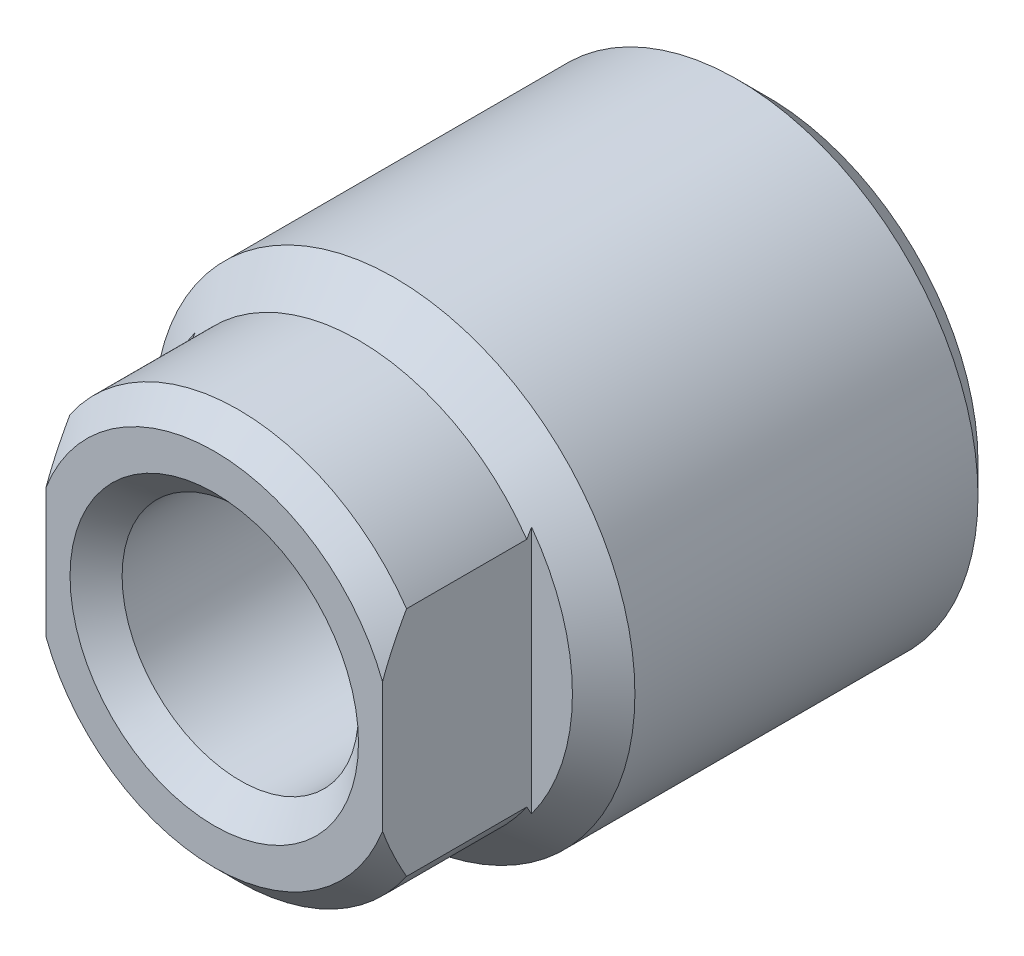
ISO-10303-21;
HEADER;
FILE_DESCRIPTION(('STEP AP214'),'2;1');
FILE_NAME('part.step','',(''),(''),'','','');
FILE_SCHEMA(('AUTOMOTIVE_DESIGN { 1 0 10303 214 1 1 1 1 }'));
ENDSEC;
DATA;
#1=APPLICATION_CONTEXT('core data for automotive mechanical design processes');
#2=APPLICATION_PROTOCOL_DEFINITION('international standard','automotive_design',2000,#1);
#3=PRODUCT_CONTEXT('',#1,'mechanical');
#4=PRODUCT('Part','Part','',(#3));
#5=PRODUCT_RELATED_PRODUCT_CATEGORY('part','',(#4));
#6=PRODUCT_DEFINITION_FORMATION('','',#4);
#7=PRODUCT_DEFINITION_CONTEXT('part definition',#1,'design');
#8=PRODUCT_DEFINITION('design','',#6,#7);
#9=PRODUCT_DEFINITION_SHAPE('','',#8);
#10=(LENGTH_UNIT() NAMED_UNIT(*) SI_UNIT(.MILLI.,.METRE.));
#11=(NAMED_UNIT(*) PLANE_ANGLE_UNIT() SI_UNIT($,.RADIAN.));
#12=(NAMED_UNIT(*) SI_UNIT($,.STERADIAN.) SOLID_ANGLE_UNIT());
#13=UNCERTAINTY_MEASURE_WITH_UNIT(LENGTH_MEASURE(1.E-05),#10,'distance_accuracy_value','');
#14=(GEOMETRIC_REPRESENTATION_CONTEXT(3) GLOBAL_UNCERTAINTY_ASSIGNED_CONTEXT((#13)) GLOBAL_UNIT_ASSIGNED_CONTEXT((#10,
#11,#12)) REPRESENTATION_CONTEXT('',''));
#15=CARTESIAN_POINT('',(0.,0.,0.));
#16=DIRECTION('',(0.,0.,1.));
#17=DIRECTION('',(1.,0.,0.));
#18=AXIS2_PLACEMENT_3D('',#15,#16,#17);
#19=CARTESIAN_POINT('',(0.,0.,11.));
#20=DIRECTION('',(0.,0.,-1.));
#21=DIRECTION('',(-1.,0.,0.));
#22=AXIS2_PLACEMENT_3D('',#19,#20,#21);
#23=CONICAL_SURFACE('',#22,4.25,0.785398163397448);
#24=CARTESIAN_POINT('',(0.,0.,11.));
#25=DIRECTION('',(0.,0.,1.));
#26=DIRECTION('',(1.,0.,0.));
#27=AXIS2_PLACEMENT_3D('',#24,#25,#26);
#28=CIRCLE('',#27,4.25);
#29=CARTESIAN_POINT('',(3.5,2.41091269024824,11.));
#30=VERTEX_POINT('',#29);
#31=CARTESIAN_POINT('',(-3.5,2.41091269024873,11.));
#32=VERTEX_POINT('',#31);
#33=EDGE_CURVE('E159',#30,#32,#28,.T.);
#34=ORIENTED_EDGE('',*,*,#33,.T.);
#35=CARTESIAN_POINT('',(-3.5,8.67992965406266,5.89098409022208));
#36=CARTESIAN_POINT('',(-3.5,8.549087704011,6.01233008445517));
#37=CARTESIAN_POINT('',(-3.5,8.41805682101567,6.13347227529112));
#38=CARTESIAN_POINT('',(-3.5,8.15555996854686,6.37528614756778));
#39=CARTESIAN_POINT('',(-3.5,8.02409399599697,6.49595782566841));
#40=CARTESIAN_POINT('',(-3.5,7.62890385389298,6.857221848517));
#41=CARTESIAN_POINT('',(-3.5,7.3644435816126,7.09701103350003));
#42=CARTESIAN_POINT('',(-3.5,6.83134077527236,7.57515611169457));
#43=CARTESIAN_POINT('',(-3.5,6.56268263545448,7.81349463129001));
#44=CARTESIAN_POINT('',(-3.5,6.02186986828108,8.28612475946837));
#45=CARTESIAN_POINT('',(-3.5,5.74971565895834,8.52041684418101));
#46=CARTESIAN_POINT('',(-3.5,5.25590291883905,8.93647291990068));
#47=CARTESIAN_POINT('',(-3.5,5.03513800024079,9.11929549488044));
#48=CARTESIAN_POINT('',(-3.5,4.58935134296384,9.47983079499538));
#49=CARTESIAN_POINT('',(-3.5,4.36432857906582,9.65754226282024));
#50=CARTESIAN_POINT('',(-3.5,4.02262540288813,9.91838075071741));
#51=CARTESIAN_POINT('',(-3.5,3.90809609714512,10.00432468014));
#52=CARTESIAN_POINT('',(-3.5,3.6773453908558,10.1739059672237));
#53=CARTESIAN_POINT('',(-3.5,3.56112406962504,10.2575434324751));
#54=CARTESIAN_POINT('',(-3.5,3.32672622607737,10.4219432563736));
#55=CARTESIAN_POINT('',(-3.5,3.20855047952229,10.5027067174865));
#56=CARTESIAN_POINT('',(-3.5,2.96984661560912,10.6606669825654));
#57=CARTESIAN_POINT('',(-3.5,2.84931876357742,10.7378641855483));
#58=CARTESIAN_POINT('',(-3.5,2.61005022130212,10.8849348615749));
#59=CARTESIAN_POINT('',(-3.5,2.4914121772027,10.9549744523345));
#60=CARTESIAN_POINT('',(-3.5,2.25112195319722,11.0897532293452));
#61=CARTESIAN_POINT('',(-3.5,2.12946943929948,11.1544918248151));
#62=CARTESIAN_POINT('',(-3.5,1.8828246710118,11.2771437792723));
#63=CARTESIAN_POINT('',(-3.5,1.75783430200038,11.335060895344));
#64=CARTESIAN_POINT('',(-3.5,1.50416235454635,11.4422049918202));
#65=CARTESIAN_POINT('',(-3.5,1.37548180929678,11.4914343775677));
#66=CARTESIAN_POINT('',(-3.5,1.14286212712896,11.5693900105879));
#67=CARTESIAN_POINT('',(-3.5,1.03964103471615,11.6002464787392));
#68=CARTESIAN_POINT('',(-3.5,0.831172733962634,11.654069002252));
#69=CARTESIAN_POINT('',(-3.5,0.725926288875963,11.6770379708218));
#70=CARTESIAN_POINT('',(-3.5,0.5141898766867,11.7139615415441));
#71=CARTESIAN_POINT('',(-3.5,0.407704996389879,11.7279448922352));
#72=CARTESIAN_POINT('',(-3.5,0.193900532898876,11.7462505835943));
#73=CARTESIAN_POINT('',(-3.5,0.0865810007172274,11.7505735101068));
#74=CARTESIAN_POINT('',(-3.5,-0.128320489862899,11.7493020566974));
#75=CARTESIAN_POINT('',(-3.5,-0.235902270669389,11.7436779121679));
#76=CARTESIAN_POINT('',(-3.5,-0.450117113780346,11.722786519246));
#77=CARTESIAN_POINT('',(-3.5,-0.556750101242306,11.707518516849));
#78=CARTESIAN_POINT('',(-3.5,-0.768685962075934,11.6681021711634));
#79=CARTESIAN_POINT('',(-3.5,-0.873983616798879,11.6439261348636));
#80=CARTESIAN_POINT('',(-3.5,-1.08245686490575,11.5878100176202));
#81=CARTESIAN_POINT('',(-3.5,-1.18563235099995,11.5558695451741));
#82=CARTESIAN_POINT('',(-3.5,-1.5129864685914,11.4428609312507));
#83=CARTESIAN_POINT('',(-3.5,-1.73279481447767,11.3490521714819));
#84=CARTESIAN_POINT('',(-3.5,-2.05463210245409,11.1925696625463));
#85=CARTESIAN_POINT('',(-3.5,-2.16071579182379,11.1377085923539));
#86=CARTESIAN_POINT('',(-3.5,-2.37055422638971,11.0236819325053));
#87=CARTESIAN_POINT('',(-3.5,-2.47430926055693,10.9645168808533));
#88=CARTESIAN_POINT('',(-3.5,-2.68103762105484,10.8419452686009));
#89=CARTESIAN_POINT('',(-3.5,-2.78398451084449,10.7784945651641));
#90=CARTESIAN_POINT('',(-3.5,-2.98803023863503,10.6486803913519));
#91=CARTESIAN_POINT('',(-3.5,-3.08912894412825,10.5823167132787));
#92=CARTESIAN_POINT('',(-3.5,-3.38981365843362,10.3798045167886));
#93=CARTESIAN_POINT('',(-3.5,-3.58700455595298,10.240103589252));
#94=CARTESIAN_POINT('',(-3.5,-4.00525449084108,9.93313367490426));
#95=CARTESIAN_POINT('',(-3.5,-4.22554992952102,9.76483538899658));
#96=CARTESIAN_POINT('',(-3.5,-4.66152728505888,9.42233378041466));
#97=CARTESIAN_POINT('',(-3.5,-4.87720851426003,9.24812958744361));
#98=CARTESIAN_POINT('',(-3.5,-5.30529737943397,8.89535689499087));
#99=CARTESIAN_POINT('',(-3.5,-5.51770175228183,8.71678445206721));
#100=CARTESIAN_POINT('',(-3.5,-5.93986268264622,8.35653379934371));
#101=CARTESIAN_POINT('',(-3.5,-6.14961917062347,8.17485550827121));
#102=CARTESIAN_POINT('',(-3.5,-6.55481523686039,7.81988279713606));
#103=CARTESIAN_POINT('',(-3.5,-6.75037240216658,7.64672232590909));
#104=CARTESIAN_POINT('',(-3.5,-7.14002398015361,7.29875705604956));
#105=CARTESIAN_POINT('',(-3.5,-7.33411836241629,7.12395222339197));
#106=CARTESIAN_POINT('',(-3.5,-7.72072571512591,6.77338744046517));
#107=CARTESIAN_POINT('',(-3.5,-7.91324109176676,6.59763014058137));
#108=CARTESIAN_POINT('',(-3.5,-8.29727834042485,6.2450501237332));
#109=CARTESIAN_POINT('',(-3.5,-8.48880025626392,6.06822745451917));
#110=CARTESIAN_POINT('',(-3.5,-8.67992965406265,5.89098409022208));
#111=B_SPLINE_CURVE_WITH_KNOTS('',3,(#35,#36,#37,#38,#39,#40,#41,#42,#43,#44,#45,#46,#47,#48,
#49,#50,#51,#52,#53,#54,#55,#56,#57,#58,#59,#60,#61,#62,#63,#64,#65,#66,#67,#68,#69,#70,#71,#72,
#73,#74,#75,#76,#77,#78,#79,#80,#81,#82,#83,#84,#85,#86,#87,#88,#89,#90,#91,#92,#93,#94,#95,#96,
#97,#98,#99,#100,#101,#102,#103,#104,#105,#106,#107,#108,#109,#110),.UNSPECIFIED.,.F.,.F.,(4,2,
2,2,2,2,2,2,2,2,2,2,2,2,2,2,2,2,2,2,2,2,2,2,2,2,2,2,2,2,2,2,2,2,2,2,2,4),(0.,0.535350036587555,
1.07070386663276,2.1416413510891,3.21903953863934,4.29631007676037,5.15617582250976,
6.01625131305532,6.44579873861161,6.875326092961,7.30468686474273,7.73399947980711,
8.14720266935121,8.5604518467551,8.97347234278525,9.38637830718966,9.70932006924441,
10.0321424257644,10.3539267349947,10.6756915294851,10.9984207699446,11.3211752461031,
11.6449416751101,11.9687244326263,12.6835908467151,13.0418467786956,13.4000580048427,
13.7627947956017,14.1255574919897,14.8503247867132,15.6818686744099,16.513535635968,
17.3459833180757,18.1784528168008,18.9620515337256,19.7456665006495,20.5276949002122,
21.3096885058474),.UNSPECIFIED.);
#112=CARTESIAN_POINT('',(-3.5,1.34629120178363,11.5));
#113=VERTEX_POINT('',#112);
#114=EDGE_CURVE('E166',#32,#113,#111,.T.);
#115=ORIENTED_EDGE('',*,*,#114,.T.);
#116=CARTESIAN_POINT('',(0.,0.,11.5));
#117=DIRECTION('',(0.,0.,1.));
#118=DIRECTION('',(1.,0.,0.));
#119=AXIS2_PLACEMENT_3D('',#116,#117,#118);
#120=CIRCLE('',#119,3.75);
#121=CARTESIAN_POINT('',(3.5,1.34629120178363,11.5));
#122=VERTEX_POINT('',#121);
#123=EDGE_CURVE('E130',#122,#113,#120,.T.);
#124=ORIENTED_EDGE('',*,*,#123,.F.);
#125=CARTESIAN_POINT('',(3.5,-8.67992965406266,5.89098409022208));
#126=CARTESIAN_POINT('',(3.5,-8.549087704011,6.01233008445517));
#127=CARTESIAN_POINT('',(3.5,-8.41805682101567,6.13347227529112));
#128=CARTESIAN_POINT('',(3.5,-8.15555996854686,6.37528614756778));
#129=CARTESIAN_POINT('',(3.5,-8.02409399599697,6.49595782566841));
#130=CARTESIAN_POINT('',(3.5,-7.62890385389298,6.857221848517));
#131=CARTESIAN_POINT('',(3.5,-7.3644435816126,7.09701103350003));
#132=CARTESIAN_POINT('',(3.5,-6.83134077527236,7.57515611169457));
#133=CARTESIAN_POINT('',(3.5,-6.56268263545448,7.81349463129001));
#134=CARTESIAN_POINT('',(3.5,-6.02186986828108,8.28612475946837));
#135=CARTESIAN_POINT('',(3.5,-5.74971565895834,8.52041684418101));
#136=CARTESIAN_POINT('',(3.5,-5.25590291883905,8.93647291990068));
#137=CARTESIAN_POINT('',(3.5,-5.03513800024079,9.11929549488044));
#138=CARTESIAN_POINT('',(3.5,-4.58935134296384,9.47983079499538));
#139=CARTESIAN_POINT('',(3.5,-4.36432857906582,9.65754226282024));
#140=CARTESIAN_POINT('',(3.5,-4.02262540288813,9.91838075071741));
#141=CARTESIAN_POINT('',(3.5,-3.90809609714512,10.00432468014));
#142=CARTESIAN_POINT('',(3.5,-3.6773453908558,10.1739059672237));
#143=CARTESIAN_POINT('',(3.5,-3.56112406962504,10.2575434324751));
#144=CARTESIAN_POINT('',(3.5,-3.32672622607737,10.4219432563736));
#145=CARTESIAN_POINT('',(3.5,-3.20855047952229,10.5027067174865));
#146=CARTESIAN_POINT('',(3.5,-2.96984661560912,10.6606669825654));
#147=CARTESIAN_POINT('',(3.5,-2.84931876357742,10.7378641855483));
#148=CARTESIAN_POINT('',(3.5,-2.61005022130212,10.8849348615749));
#149=CARTESIAN_POINT('',(3.5,-2.4914121772027,10.9549744523345));
#150=CARTESIAN_POINT('',(3.5,-2.25112195319722,11.0897532293452));
#151=CARTESIAN_POINT('',(3.5,-2.12946943929948,11.1544918248151));
#152=CARTESIAN_POINT('',(3.5,-1.8828246710118,11.2771437792723));
#153=CARTESIAN_POINT('',(3.5,-1.75783430200038,11.335060895344));
#154=CARTESIAN_POINT('',(3.5,-1.50416235454635,11.4422049918202));
#155=CARTESIAN_POINT('',(3.5,-1.37548180929678,11.4914343775677));
#156=CARTESIAN_POINT('',(3.5,-1.14286212712896,11.5693900105879));
#157=CARTESIAN_POINT('',(3.5,-1.03964103471615,11.6002464787392));
#158=CARTESIAN_POINT('',(3.5,-0.831172733962634,11.654069002252));
#159=CARTESIAN_POINT('',(3.5,-0.725926288875963,11.6770379708218));
#160=CARTESIAN_POINT('',(3.5,-0.5141898766867,11.7139615415441));
#161=CARTESIAN_POINT('',(3.5,-0.407704996389879,11.7279448922352));
#162=CARTESIAN_POINT('',(3.5,-0.193900532898876,11.7462505835943));
#163=CARTESIAN_POINT('',(3.5,-0.0865810007172274,11.7505735101068));
#164=CARTESIAN_POINT('',(3.5,0.128320489862899,11.7493020566974));
#165=CARTESIAN_POINT('',(3.5,0.235902270669389,11.7436779121679));
#166=CARTESIAN_POINT('',(3.5,0.450117113780346,11.722786519246));
#167=CARTESIAN_POINT('',(3.5,0.556750101242306,11.707518516849));
#168=CARTESIAN_POINT('',(3.5,0.768685962075934,11.6681021711634));
#169=CARTESIAN_POINT('',(3.5,0.873983616798879,11.6439261348636));
#170=CARTESIAN_POINT('',(3.5,1.08245686490575,11.5878100176202));
#171=CARTESIAN_POINT('',(3.5,1.18563235099995,11.5558695451741));
#172=CARTESIAN_POINT('',(3.5,1.5129864685914,11.4428609312507));
#173=CARTESIAN_POINT('',(3.5,1.73279481447767,11.3490521714819));
#174=CARTESIAN_POINT('',(3.5,2.05463210245409,11.1925696625463));
#175=CARTESIAN_POINT('',(3.5,2.16071579182379,11.1377085923539));
#176=CARTESIAN_POINT('',(3.5,2.37055422638971,11.0236819325053));
#177=CARTESIAN_POINT('',(3.5,2.47430926055693,10.9645168808533));
#178=CARTESIAN_POINT('',(3.5,2.68103762105484,10.8419452686009));
#179=CARTESIAN_POINT('',(3.5,2.78398451084449,10.7784945651641));
#180=CARTESIAN_POINT('',(3.5,2.98803023863503,10.6486803913519));
#181=CARTESIAN_POINT('',(3.5,3.08912894412825,10.5823167132787));
#182=CARTESIAN_POINT('',(3.5,3.38981365843362,10.3798045167886));
#183=CARTESIAN_POINT('',(3.5,3.58700455595298,10.240103589252));
#184=CARTESIAN_POINT('',(3.5,4.00525449084108,9.93313367490426));
#185=CARTESIAN_POINT('',(3.5,4.22554992952102,9.76483538899658));
#186=CARTESIAN_POINT('',(3.5,4.66152728505888,9.42233378041466));
#187=CARTESIAN_POINT('',(3.5,4.87720851426003,9.24812958744361));
#188=CARTESIAN_POINT('',(3.5,5.30529737943397,8.89535689499087));
#189=CARTESIAN_POINT('',(3.5,5.51770175228183,8.71678445206721));
#190=CARTESIAN_POINT('',(3.5,5.93986268264622,8.35653379934371));
#191=CARTESIAN_POINT('',(3.5,6.14961917062347,8.17485550827121));
#192=CARTESIAN_POINT('',(3.5,6.55481523686039,7.81988279713606));
#193=CARTESIAN_POINT('',(3.5,6.75037240216658,7.64672232590909));
#194=CARTESIAN_POINT('',(3.5,7.14002398015361,7.29875705604956));
#195=CARTESIAN_POINT('',(3.5,7.33411836241629,7.12395222339197));
#196=CARTESIAN_POINT('',(3.5,7.72072571512591,6.77338744046517));
#197=CARTESIAN_POINT('',(3.5,7.91324109176676,6.59763014058137));
#198=CARTESIAN_POINT('',(3.5,8.29727834042485,6.2450501237332));
#199=CARTESIAN_POINT('',(3.5,8.48880025626392,6.06822745451917));
#200=CARTESIAN_POINT('',(3.5,8.67992965406265,5.89098409022208));
#201=B_SPLINE_CURVE_WITH_KNOTS('',3,(#125,#126,#127,#128,#129,#130,#131,#132,#133,#134,#135,
#136,#137,#138,#139,#140,#141,#142,#143,#144,#145,#146,#147,#148,#149,#150,#151,#152,#153,#154,
#155,#156,#157,#158,#159,#160,#161,#162,#163,#164,#165,#166,#167,#168,#169,#170,#171,#172,#173,
#174,#175,#176,#177,#178,#179,#180,#181,#182,#183,#184,#185,#186,#187,#188,#189,#190,#191,#192,
#193,#194,#195,#196,#197,#198,#199,#200),.UNSPECIFIED.,.F.,.F.,(4,2,2,2,2,2,2,2,2,2,2,2,2,2,2,2,
2,2,2,2,2,2,2,2,2,2,2,2,2,2,2,2,2,2,2,2,2,4),(0.,0.535350036587555,1.07070386663276,
2.1416413510891,3.21903953863934,4.29631007676037,5.15617582250976,6.01625131305532,
6.44579873861161,6.875326092961,7.30468686474273,7.73399947980711,8.14720266935121,
8.5604518467551,8.97347234278525,9.38637830718966,9.70932006924441,10.0321424257644,
10.3539267349947,10.6756915294851,10.9984207699446,11.3211752461031,11.6449416751101,
11.9687244326263,12.6835908467151,13.0418467786956,13.4000580048427,13.7627947956017,
14.1255574919897,14.8503247867132,15.6818686744099,16.513535635968,17.3459833180757,
18.1784528168008,18.9620515337256,19.7456665006495,20.5276949002122,21.3096885058474),.UNSPECIFIED.);
#202=EDGE_CURVE('E199',#122,#30,#201,.T.);
#203=ORIENTED_EDGE('',*,*,#202,.T.);
#204=EDGE_LOOP('',(#34,#115,#124,#203));
#205=FACE_BOUND('',#204,.T.);
#206=ADVANCED_FACE('F36',(#205),#23,.T.);
#207=CARTESIAN_POINT('',(0.,0.,0.));
#208=DIRECTION('',(0.,0.,1.));
#209=DIRECTION('',(1.,0.,0.));
#210=AXIS2_PLACEMENT_3D('',#207,#208,#209);
#211=CYLINDRICAL_SURFACE('',#210,4.25);
#212=CARTESIAN_POINT('',(0.,0.,8.5));
#213=DIRECTION('',(0.,0.,1.));
#214=DIRECTION('',(1.,0.,0.));
#215=AXIS2_PLACEMENT_3D('',#212,#213,#214);
#216=CIRCLE('',#215,4.25);
#217=CARTESIAN_POINT('',(3.5,2.41091269024824,8.5));
#218=VERTEX_POINT('',#217);
#219=CARTESIAN_POINT('',(-3.5,2.41091269024824,8.5));
#220=VERTEX_POINT('',#219);
#221=EDGE_CURVE('E155',#218,#220,#216,.T.);
#222=ORIENTED_EDGE('',*,*,#221,.T.);
#223=DIRECTION('',(0.,0.,1.));
#224=VECTOR('',#223,1.);
#225=CARTESIAN_POINT('',(-3.5,2.41091269024824,0.));
#226=LINE('',#225,#224);
#227=EDGE_CURVE('E121',#220,#32,#226,.T.);
#228=ORIENTED_EDGE('',*,*,#227,.T.);
#229=ORIENTED_EDGE('',*,*,#33,.F.);
#230=DIRECTION('',(0.,0.,1.));
#231=VECTOR('',#230,1.);
#232=CARTESIAN_POINT('',(3.5,2.41091269024824,0.));
#233=LINE('',#232,#231);
#234=EDGE_CURVE('E128',#30,#218,#233,.F.);
#235=ORIENTED_EDGE('',*,*,#234,.T.);
#236=EDGE_LOOP('',(#222,#228,#229,#235));
#237=FACE_BOUND('',#236,.T.);
#238=ADVANCED_FACE('F223',(#237),#211,.T.);
#239=CARTESIAN_POINT('',(-3.5,-1.34629120178363,11.5));
#240=VERTEX_POINT('',#239);
#241=CARTESIAN_POINT('',(3.5,-1.34629120178363,11.5));
#242=VERTEX_POINT('',#241);
#243=EDGE_CURVE('E133',#240,#242,#120,.T.);
#244=ORIENTED_EDGE('',*,*,#243,.F.);
#245=CARTESIAN_POINT('',(-3.5,-2.41091269024824,11.));
#246=VERTEX_POINT('',#245);
#247=EDGE_CURVE('E167',#240,#246,#111,.T.);
#248=ORIENTED_EDGE('',*,*,#247,.T.);
#249=CARTESIAN_POINT('',(3.5,-2.41091269024873,11.));
#250=VERTEX_POINT('',#249);
#251=EDGE_CURVE('E162',#246,#250,#28,.T.);
#252=ORIENTED_EDGE('',*,*,#251,.T.);
#253=EDGE_CURVE('E112',#250,#242,#201,.T.);
#254=ORIENTED_EDGE('',*,*,#253,.T.);
#255=EDGE_LOOP('',(#244,#248,#252,#254));
#256=FACE_BOUND('',#255,.T.);
#257=ADVANCED_FACE('F38',(#256),#23,.T.);
#258=CARTESIAN_POINT('',(0.,3.75,11.5));
#259=DIRECTION('',(0.,0.,-1.));
#260=DIRECTION('',(-1.,0.,0.));
#261=AXIS2_PLACEMENT_3D('',#258,#259,#260);
#262=PLANE('',#261);
#263=CARTESIAN_POINT('',(0.,0.,11.5));
#264=DIRECTION('',(0.,0.,1.));
#265=DIRECTION('',(1.,0.,0.));
#266=AXIS2_PLACEMENT_3D('',#263,#264,#265);
#267=CIRCLE('',#266,3.);
#268=CARTESIAN_POINT('',(3.,0.,11.5));
#269=VERTEX_POINT('',#268);
#270=EDGE_CURVE('E134',#269,#269,#267,.T.);
#271=ORIENTED_EDGE('',*,*,#270,.F.);
#272=EDGE_LOOP('',(#271));
#273=FACE_BOUND('',#272,.T.);
#274=ORIENTED_EDGE('',*,*,#123,.T.);
#275=DIRECTION('',(0.,-1.,0.));
#276=VECTOR('',#275,1.);
#277=CARTESIAN_POINT('',(-3.5,3.75,11.5));
#278=LINE('',#277,#276);
#279=EDGE_CURVE('E163',#113,#240,#278,.T.);
#280=ORIENTED_EDGE('',*,*,#279,.T.);
#281=ORIENTED_EDGE('',*,*,#243,.T.);
#282=DIRECTION('',(0.,1.,0.));
#283=VECTOR('',#282,1.);
#284=CARTESIAN_POINT('',(3.5,3.75,11.5));
#285=LINE('',#284,#283);
#286=EDGE_CURVE('E205',#242,#122,#285,.T.);
#287=ORIENTED_EDGE('',*,*,#286,.T.);
#288=EDGE_LOOP('',(#274,#280,#281,#287));
#289=FACE_BOUND('',#288,.T.);
#290=ADVANCED_FACE('F215',(#273,#289),#262,.F.);
#291=CARTESIAN_POINT('',(0.,0.,11.5));
#292=DIRECTION('',(0.,0.,1.));
#293=DIRECTION('',(1.,0.,0.));
#294=AXIS2_PLACEMENT_3D('',#291,#292,#293);
#295=CONICAL_SURFACE('',#294,3.,0.78539816339745);
#296=CARTESIAN_POINT('',(0.,0.,10.9585));
#297=DIRECTION('',(0.,0.,1.));
#298=DIRECTION('',(1.,0.,0.));
#299=AXIS2_PLACEMENT_3D('',#296,#297,#298);
#300=CIRCLE('',#299,2.4585);
#301=CARTESIAN_POINT('',(2.4585,0.,10.9585));
#302=VERTEX_POINT('',#301);
#303=EDGE_CURVE('E137',#302,#302,#300,.T.);
#304=ORIENTED_EDGE('',*,*,#303,.F.);
#305=EDGE_LOOP('',(#304));
#306=FACE_BOUND('',#305,.T.);
#307=ORIENTED_EDGE('',*,*,#270,.T.);
#308=EDGE_LOOP('',(#307));
#309=FACE_BOUND('',#308,.T.);
#310=ADVANCED_FACE('F237',(#306,#309),#295,.F.);
#311=CARTESIAN_POINT('',(0.,0.,0.));
#312=DIRECTION('',(0.,0.,1.));
#313=DIRECTION('',(1.,0.,0.));
#314=AXIS2_PLACEMENT_3D('',#311,#312,#313);
#315=CYLINDRICAL_SURFACE('',#314,2.4585);
#316=CARTESIAN_POINT('',(0.,0.,0.5415));
#317=DIRECTION('',(0.,0.,1.));
#318=DIRECTION('',(1.,0.,0.));
#319=AXIS2_PLACEMENT_3D('',#316,#317,#318);
#320=CIRCLE('',#319,2.4585);
#321=CARTESIAN_POINT('',(2.4585,0.,0.5415));
#322=VERTEX_POINT('',#321);
#323=EDGE_CURVE('E140',#322,#322,#320,.T.);
#324=ORIENTED_EDGE('',*,*,#323,.F.);
#325=EDGE_LOOP('',(#324));
#326=FACE_BOUND('',#325,.T.);
#327=ORIENTED_EDGE('',*,*,#303,.T.);
#328=EDGE_LOOP('',(#327));
#329=FACE_BOUND('',#328,.T.);
#330=ADVANCED_FACE('F242',(#326,#329),#315,.F.);
#331=CARTESIAN_POINT('',(0.,0.,0.5415));
#332=DIRECTION('',(0.,0.,-1.));
#333=DIRECTION('',(-1.,0.,0.));
#334=AXIS2_PLACEMENT_3D('',#331,#332,#333);
#335=CONICAL_SURFACE('',#334,2.4585,0.785398163397449);
#336=CARTESIAN_POINT('',(0.,0.,0.));
#337=DIRECTION('',(0.,0.,1.));
#338=DIRECTION('',(1.,0.,0.));
#339=AXIS2_PLACEMENT_3D('',#336,#337,#338);
#340=CIRCLE('',#339,3.);
#341=CARTESIAN_POINT('',(3.,0.,0.));
#342=VERTEX_POINT('',#341);
#343=EDGE_CURVE('E143',#342,#342,#340,.T.);
#344=ORIENTED_EDGE('',*,*,#343,.F.);
#345=EDGE_LOOP('',(#344));
#346=FACE_BOUND('',#345,.T.);
#347=ORIENTED_EDGE('',*,*,#323,.T.);
#348=EDGE_LOOP('',(#347));
#349=FACE_BOUND('',#348,.T.);
#350=ADVANCED_FACE('F249',(#346,#349),#335,.F.);
#351=CARTESIAN_POINT('',(0.,3.,0.));
#352=DIRECTION('',(0.,0.,1.));
#353=DIRECTION('',(1.,0.,0.));
#354=AXIS2_PLACEMENT_3D('',#351,#352,#353);
#355=PLANE('',#354);
#356=CARTESIAN_POINT('',(0.,0.,0.));
#357=DIRECTION('',(0.,0.,1.));
#358=DIRECTION('',(1.,0.,0.));
#359=AXIS2_PLACEMENT_3D('',#356,#357,#358);
#360=CIRCLE('',#359,4.3865);
#361=CARTESIAN_POINT('',(4.3865,0.,0.));
#362=VERTEX_POINT('',#361);
#363=EDGE_CURVE('E146',#362,#362,#360,.T.);
#364=ORIENTED_EDGE('',*,*,#363,.F.);
#365=EDGE_LOOP('',(#364));
#366=FACE_BOUND('',#365,.T.);
#367=ORIENTED_EDGE('',*,*,#343,.T.);
#368=EDGE_LOOP('',(#367));
#369=FACE_BOUND('',#368,.T.);
#370=ADVANCED_FACE('F253',(#366,#369),#355,.F.);
#371=CARTESIAN_POINT('',(0.,0.,0.));
#372=DIRECTION('',(0.,0.,1.));
#373=DIRECTION('',(1.,0.,0.));
#374=AXIS2_PLACEMENT_3D('',#371,#372,#373);
#375=CONICAL_SURFACE('',#374,4.3865,0.785398163397449);
#376=CARTESIAN_POINT('',(0.,0.,0.6135));
#377=DIRECTION('',(0.,0.,1.));
#378=DIRECTION('',(1.,0.,0.));
#379=AXIS2_PLACEMENT_3D('',#376,#377,#378);
#380=CIRCLE('',#379,5.);
#381=CARTESIAN_POINT('',(5.,0.,0.6135));
#382=VERTEX_POINT('',#381);
#383=EDGE_CURVE('E149',#382,#382,#380,.T.);
#384=ORIENTED_EDGE('',*,*,#383,.F.);
#385=EDGE_LOOP('',(#384));
#386=FACE_BOUND('',#385,.T.);
#387=ORIENTED_EDGE('',*,*,#363,.T.);
#388=EDGE_LOOP('',(#387));
#389=FACE_BOUND('',#388,.T.);
#390=ADVANCED_FACE('F257',(#386,#389),#375,.T.);
#391=CARTESIAN_POINT('',(0.,0.,0.));
#392=DIRECTION('',(0.,0.,1.));
#393=DIRECTION('',(1.,0.,0.));
#394=AXIS2_PLACEMENT_3D('',#391,#392,#393);
#395=CYLINDRICAL_SURFACE('',#394,5.);
#396=CARTESIAN_POINT('',(0.,0.,7.75));
#397=DIRECTION('',(0.,0.,1.));
#398=DIRECTION('',(1.,0.,0.));
#399=AXIS2_PLACEMENT_3D('',#396,#397,#398);
#400=CIRCLE('',#399,5.);
#401=CARTESIAN_POINT('',(5.,0.,7.75));
#402=VERTEX_POINT('',#401);
#403=EDGE_CURVE('E152',#402,#402,#400,.T.);
#404=ORIENTED_EDGE('',*,*,#403,.F.);
#405=EDGE_LOOP('',(#404));
#406=FACE_BOUND('',#405,.T.);
#407=ORIENTED_EDGE('',*,*,#383,.T.);
#408=EDGE_LOOP('',(#407));
#409=FACE_BOUND('',#408,.T.);
#410=ADVANCED_FACE('F227',(#406,#409),#395,.T.);
#411=CARTESIAN_POINT('',(0.,0.,7.75));
#412=DIRECTION('',(0.,0.,-1.));
#413=DIRECTION('',(-1.,0.,0.));
#414=AXIS2_PLACEMENT_3D('',#411,#412,#413);
#415=CONICAL_SURFACE('',#414,5.,0.785398163397448);
#416=CARTESIAN_POINT('',(0.,0.,8.4));
#417=DIRECTION('',(0.,0.,-1.));
#418=DIRECTION('',(-1.,0.,0.));
#419=AXIS2_PLACEMENT_3D('',#416,#417,#418);
#420=CIRCLE('',#419,4.35);
#421=CARTESIAN_POINT('',(-3.5,-2.5831182706179,8.4));
#422=VERTEX_POINT('',#421);
#423=CARTESIAN_POINT('',(-3.5,2.5831182706179,8.4));
#424=VERTEX_POINT('',#423);
#425=EDGE_CURVE('E11',#422,#424,#420,.T.);
#426=ORIENTED_EDGE('',*,*,#425,.T.);
#427=CARTESIAN_POINT('',(-3.5,9.74078282761453,2.39950000749963));
#428=CARTESIAN_POINT('',(-3.5,9.5867799074486,2.54442863796654));
#429=CARTESIAN_POINT('',(-3.5,9.43258362030784,2.68915168453825));
#430=CARTESIAN_POINT('',(-3.5,9.12374083345768,2.97811836638069));
#431=CARTESIAN_POINT('',(-3.5,8.96909433107869,3.12236199879778));
#432=CARTESIAN_POINT('',(-3.5,8.50415397093375,3.55448543708457));
#433=CARTESIAN_POINT('',(-3.5,8.19309077845915,3.84153952112968));
#434=CARTESIAN_POINT('',(-3.5,7.55968006373182,4.42042763119953));
#435=CARTESIAN_POINT('',(-3.5,7.23725626629442,4.7121782976377));
#436=CARTESIAN_POINT('',(-3.5,6.58855553337733,5.29094872287458));
#437=CARTESIAN_POINT('',(-3.5,6.26228132407499,5.57797152025127));
#438=CARTESIAN_POINT('',(-3.5,5.76850884464538,6.00323817269817));
#439=CARTESIAN_POINT('',(-3.5,5.60324336301629,6.14407271009514));
#440=CARTESIAN_POINT('',(-3.5,5.27087183050439,6.42355004352788));
#441=CARTESIAN_POINT('',(-3.5,5.10376582185616,6.56219288967935));
#442=CARTESIAN_POINT('',(-3.5,4.76689698844052,6.83698134288485));
#443=CARTESIAN_POINT('',(-3.5,4.59712914594213,6.97312081481323));
#444=CARTESIAN_POINT('',(-3.5,4.25471140534054,7.24170833371619));
#445=CARTESIAN_POINT('',(-3.5,4.08206177194809,7.37415671678943));
#446=CARTESIAN_POINT('',(-3.5,3.73506085798265,7.63263572682679));
#447=CARTESIAN_POINT('',(-3.5,3.56075150112958,7.75872235583338));
#448=CARTESIAN_POINT('',(-3.5,3.20741367976623,8.00433459797698));
#449=CARTESIAN_POINT('',(-3.5,3.02838316638671,8.12385729078381));
#450=CARTESIAN_POINT('',(-3.5,2.66503976043353,8.3531130307753));
#451=CARTESIAN_POINT('',(-3.5,2.48074901816126,8.46288087151587));
#452=CARTESIAN_POINT('',(-3.5,2.10482069586695,8.6688785949399));
#453=CARTESIAN_POINT('',(-3.5,1.9131918700783,8.76512400647501));
#454=CARTESIAN_POINT('',(-3.5,1.61111949925362,8.89815734998096));
#455=CARTESIAN_POINT('',(-3.5,1.50377468267197,8.94196216844729));
#456=CARTESIAN_POINT('',(-3.5,1.28639210165815,9.02245353737203));
#457=CARTESIAN_POINT('',(-3.5,1.17635385542785,9.05913880365679));
#458=CARTESIAN_POINT('',(-3.5,0.95438206950261,9.1237555485861));
#459=CARTESIAN_POINT('',(-3.5,0.842462868724564,9.15173562759878));
#460=CARTESIAN_POINT('',(-3.5,0.616589469646223,9.19782146842829));
#461=CARTESIAN_POINT('',(-3.5,0.502635508588888,9.21592837374417));
#462=CARTESIAN_POINT('',(-3.5,0.272023887576203,9.24133810998241));
#463=CARTESIAN_POINT('',(-3.5,0.15535029727689,9.24849932993092));
#464=CARTESIAN_POINT('',(-3.5,-0.0781192251632082,9.25107463743734));
#465=CARTESIAN_POINT('',(-3.5,-0.194915147172848,9.24648963107796));
#466=CARTESIAN_POINT('',(-3.5,-0.427893805061345,9.22585850220542));
#467=CARTESIAN_POINT('',(-3.5,-0.544072845153065,9.20977137866978));
#468=CARTESIAN_POINT('',(-3.5,-0.77448625305923,9.16712549959073));
#469=CARTESIAN_POINT('',(-3.5,-0.888720044789015,9.14056369636126));
#470=CARTESIAN_POINT('',(-3.5,-1.15770895661471,9.06655235147306));
#471=CARTESIAN_POINT('',(-3.5,-1.31132891999205,9.01500043877718));
#472=CARTESIAN_POINT('',(-3.5,-1.61339028565325,8.89856546220363));
#473=CARTESIAN_POINT('',(-3.5,-1.76182857088823,8.83367453053451));
#474=CARTESIAN_POINT('',(-3.5,-2.0554986833968,8.69312126719446));
#475=CARTESIAN_POINT('',(-3.5,-2.20067617247206,8.61734671309573));
#476=CARTESIAN_POINT('',(-3.5,-2.41518774313175,8.49798652514006));
#477=CARTESIAN_POINT('',(-3.5,-2.48614005966028,8.45725578779337));
#478=CARTESIAN_POINT('',(-3.5,-2.62706112335527,8.37413265470055));
#479=CARTESIAN_POINT('',(-3.5,-2.69702991989062,8.33174034276664));
#480=CARTESIAN_POINT('',(-3.5,-2.93807504039359,8.1822740830277));
#481=CARTESIAN_POINT('',(-3.5,-3.10688959707627,8.07154846264788));
#482=CARTESIAN_POINT('',(-3.5,-3.44025211336702,7.84382506656342));
#483=CARTESIAN_POINT('',(-3.5,-3.60479882767985,7.72682549008682));
#484=CARTESIAN_POINT('',(-3.5,-3.93065198831303,7.48808729565824));
#485=CARTESIAN_POINT('',(-3.5,-4.09195511192136,7.36634415946182));
#486=CARTESIAN_POINT('',(-3.5,-4.41183254831665,7.11937399526806));
#487=CARTESIAN_POINT('',(-3.5,-4.57040715019011,6.99414734007385));
#488=CARTESIAN_POINT('',(-3.5,-4.88602747420354,6.74047312211924));
#489=CARTESIAN_POINT('',(-3.5,-5.04306423586619,6.61201443822192));
#490=CARTESIAN_POINT('',(-3.5,-5.35535686496258,6.35294821077159));
#491=CARTESIAN_POINT('',(-3.5,-5.51061269226633,6.22234061895779));
#492=CARTESIAN_POINT('',(-3.5,-5.97403365910126,5.82811099429285));
#493=CARTESIAN_POINT('',(-3.5,-6.28002835041304,5.56193889701761));
#494=CARTESIAN_POINT('',(-3.5,-6.85261223664351,5.05632965226084));
#495=CARTESIAN_POINT('',(-3.5,-7.1196415001778,4.81738782073437));
#496=CARTESIAN_POINT('',(-3.5,-7.65139037034741,4.33686709049599));
#497=CARTESIAN_POINT('',(-3.5,-7.91610961306492,4.0952877893089));
#498=CARTESIAN_POINT('',(-3.5,-8.44162130392652,3.61214745942243));
#499=CARTESIAN_POINT('',(-3.5,-8.70242819324688,3.37060210709669));
#500=CARTESIAN_POINT('',(-3.5,-9.22259064112124,2.88605358641438));
#501=CARTESIAN_POINT('',(-3.5,-9.48194647085367,2.64305070931689));
#502=CARTESIAN_POINT('',(-3.5,-9.74078282761453,2.39950000749963));
#503=B_SPLINE_CURVE_WITH_KNOTS('',3,(#427,#428,#429,#430,#431,#432,#433,#434,#435,#436,#437,
#438,#439,#440,#441,#442,#443,#444,#445,#446,#447,#448,#449,#450,#451,#452,#453,#454,#455,#456,
#457,#458,#459,#460,#461,#462,#463,#464,#465,#466,#467,#468,#469,#470,#471,#472,#473,#474,#475,
#476,#477,#478,#479,#480,#481,#482,#483,#484,#485,#486,#487,#488,#489,#490,#491,#492,#493,#494,
#495,#496,#497,#498,#499,#500,#501,#502),.UNSPECIFIED.,.F.,.F.,(4,2,2,2,2,2,2,2,2,2,2,2,2,2,2,2,
2,2,2,2,2,2,2,2,2,2,2,2,2,2,2,2,2,2,2,2,2,4),(0.,0.634421182557574,1.26884613467633,
2.53865056572881,3.84311056830765,5.14669663175373,5.79808360893398,6.4494556697469,
7.10225449282944,7.75499367863712,8.40028152439509,9.04585417427072,9.68902311221128,
10.3314473045361,10.6790651330479,11.0267456042083,11.372448647556,11.7181116434868,
12.0682099294434,12.4182812102626,12.7696066342874,13.1210343545702,13.6062917371153,
14.0918361659352,14.5828042437395,14.8282238860168,15.0736311648673,15.6790684292362,
16.2846804081975,16.8908840540057,17.4970230721481,18.1056529200785,18.7142964554998,
19.9309028248541,21.0058648277204,22.0809932275582,23.1474201662531,24.2136406635607),.UNSPECIFIED.);
#504=EDGE_CURVE('E219',#424,#220,#503,.T.);
#505=ORIENTED_EDGE('',*,*,#504,.T.);
#506=ORIENTED_EDGE('',*,*,#221,.F.);
#507=CARTESIAN_POINT('',(3.5,-9.74078282761453,2.39950000749963));
#508=CARTESIAN_POINT('',(3.5,-9.5867799074486,2.54442863796654));
#509=CARTESIAN_POINT('',(3.5,-9.43258362030784,2.68915168453825));
#510=CARTESIAN_POINT('',(3.5,-9.12374083345768,2.97811836638069));
#511=CARTESIAN_POINT('',(3.5,-8.96909433107869,3.12236199879778));
#512=CARTESIAN_POINT('',(3.5,-8.50415397093375,3.55448543708457));
#513=CARTESIAN_POINT('',(3.5,-8.19309077845915,3.84153952112968));
#514=CARTESIAN_POINT('',(3.5,-7.55968006373182,4.42042763119953));
#515=CARTESIAN_POINT('',(3.5,-7.23725626629442,4.7121782976377));
#516=CARTESIAN_POINT('',(3.5,-6.58855553337733,5.29094872287458));
#517=CARTESIAN_POINT('',(3.5,-6.26228132407499,5.57797152025127));
#518=CARTESIAN_POINT('',(3.5,-5.76850884464538,6.00323817269817));
#519=CARTESIAN_POINT('',(3.5,-5.60324336301629,6.14407271009514));
#520=CARTESIAN_POINT('',(3.5,-5.27087183050439,6.42355004352788));
#521=CARTESIAN_POINT('',(3.5,-5.10376582185616,6.56219288967935));
#522=CARTESIAN_POINT('',(3.5,-4.76689698844052,6.83698134288485));
#523=CARTESIAN_POINT('',(3.5,-4.59712914594213,6.97312081481323));
#524=CARTESIAN_POINT('',(3.5,-4.25471140534054,7.24170833371619));
#525=CARTESIAN_POINT('',(3.5,-4.08206177194809,7.37415671678943));
#526=CARTESIAN_POINT('',(3.5,-3.73506085798265,7.63263572682679));
#527=CARTESIAN_POINT('',(3.5,-3.56075150112958,7.75872235583338));
#528=CARTESIAN_POINT('',(3.5,-3.20741367976623,8.00433459797698));
#529=CARTESIAN_POINT('',(3.5,-3.02838316638671,8.12385729078381));
#530=CARTESIAN_POINT('',(3.5,-2.66503976043353,8.3531130307753));
#531=CARTESIAN_POINT('',(3.5,-2.48074901816126,8.46288087151587));
#532=CARTESIAN_POINT('',(3.5,-2.10482069586695,8.6688785949399));
#533=CARTESIAN_POINT('',(3.5,-1.9131918700783,8.76512400647501));
#534=CARTESIAN_POINT('',(3.5,-1.61111949925362,8.89815734998096));
#535=CARTESIAN_POINT('',(3.5,-1.50377468267197,8.94196216844729));
#536=CARTESIAN_POINT('',(3.5,-1.28639210165815,9.02245353737203));
#537=CARTESIAN_POINT('',(3.5,-1.17635385542785,9.05913880365679));
#538=CARTESIAN_POINT('',(3.5,-0.95438206950261,9.1237555485861));
#539=CARTESIAN_POINT('',(3.5,-0.842462868724564,9.15173562759878));
#540=CARTESIAN_POINT('',(3.5,-0.616589469646223,9.19782146842829));
#541=CARTESIAN_POINT('',(3.5,-0.502635508588888,9.21592837374417));
#542=CARTESIAN_POINT('',(3.5,-0.272023887576203,9.24133810998241));
#543=CARTESIAN_POINT('',(3.5,-0.15535029727689,9.24849932993092));
#544=CARTESIAN_POINT('',(3.5,0.0781192251632082,9.25107463743734));
#545=CARTESIAN_POINT('',(3.5,0.194915147172848,9.24648963107796));
#546=CARTESIAN_POINT('',(3.5,0.427893805061345,9.22585850220542));
#547=CARTESIAN_POINT('',(3.5,0.544072845153065,9.20977137866978));
#548=CARTESIAN_POINT('',(3.5,0.77448625305923,9.16712549959073));
#549=CARTESIAN_POINT('',(3.5,0.888720044789015,9.14056369636126));
#550=CARTESIAN_POINT('',(3.5,1.15770895661471,9.06655235147306));
#551=CARTESIAN_POINT('',(3.5,1.31132891999205,9.01500043877718));
#552=CARTESIAN_POINT('',(3.5,1.61339028565325,8.89856546220363));
#553=CARTESIAN_POINT('',(3.5,1.76182857088823,8.83367453053451));
#554=CARTESIAN_POINT('',(3.5,2.0554986833968,8.69312126719446));
#555=CARTESIAN_POINT('',(3.5,2.20067617247206,8.61734671309573));
#556=CARTESIAN_POINT('',(3.5,2.41518774313175,8.49798652514006));
#557=CARTESIAN_POINT('',(3.5,2.48614005966028,8.45725578779337));
#558=CARTESIAN_POINT('',(3.5,2.62706112335527,8.37413265470055));
#559=CARTESIAN_POINT('',(3.5,2.69702991989062,8.33174034276664));
#560=CARTESIAN_POINT('',(3.5,2.93807504039359,8.1822740830277));
#561=CARTESIAN_POINT('',(3.5,3.10688959707627,8.07154846264788));
#562=CARTESIAN_POINT('',(3.5,3.44025211336702,7.84382506656342));
#563=CARTESIAN_POINT('',(3.5,3.60479882767985,7.72682549008682));
#564=CARTESIAN_POINT('',(3.5,3.93065198831303,7.48808729565824));
#565=CARTESIAN_POINT('',(3.5,4.09195511192136,7.36634415946182));
#566=CARTESIAN_POINT('',(3.5,4.41183254831665,7.11937399526806));
#567=CARTESIAN_POINT('',(3.5,4.57040715019011,6.99414734007385));
#568=CARTESIAN_POINT('',(3.5,4.88602747420354,6.74047312211924));
#569=CARTESIAN_POINT('',(3.5,5.04306423586619,6.61201443822192));
#570=CARTESIAN_POINT('',(3.5,5.35535686496258,6.35294821077159));
#571=CARTESIAN_POINT('',(3.5,5.51061269226633,6.22234061895779));
#572=CARTESIAN_POINT('',(3.5,5.97403365910126,5.82811099429285));
#573=CARTESIAN_POINT('',(3.5,6.28002835041304,5.56193889701761));
#574=CARTESIAN_POINT('',(3.5,6.85261223664351,5.05632965226084));
#575=CARTESIAN_POINT('',(3.5,7.1196415001778,4.81738782073437));
#576=CARTESIAN_POINT('',(3.5,7.65139037034741,4.33686709049599));
#577=CARTESIAN_POINT('',(3.5,7.91610961306492,4.0952877893089));
#578=CARTESIAN_POINT('',(3.5,8.44162130392652,3.61214745942243));
#579=CARTESIAN_POINT('',(3.5,8.70242819324688,3.37060210709669));
#580=CARTESIAN_POINT('',(3.5,9.22259064112124,2.88605358641438));
#581=CARTESIAN_POINT('',(3.5,9.48194647085367,2.64305070931689));
#582=CARTESIAN_POINT('',(3.5,9.74078282761453,2.39950000749963));
#583=B_SPLINE_CURVE_WITH_KNOTS('',3,(#507,#508,#509,#510,#511,#512,#513,#514,#515,#516,#517,
#518,#519,#520,#521,#522,#523,#524,#525,#526,#527,#528,#529,#530,#531,#532,#533,#534,#535,#536,
#537,#538,#539,#540,#541,#542,#543,#544,#545,#546,#547,#548,#549,#550,#551,#552,#553,#554,#555,
#556,#557,#558,#559,#560,#561,#562,#563,#564,#565,#566,#567,#568,#569,#570,#571,#572,#573,#574,
#575,#576,#577,#578,#579,#580,#581,#582),.UNSPECIFIED.,.F.,.F.,(4,2,2,2,2,2,2,2,2,2,2,2,2,2,2,2,
2,2,2,2,2,2,2,2,2,2,2,2,2,2,2,2,2,2,2,2,2,4),(0.,0.634421182557574,1.26884613467633,
2.53865056572881,3.84311056830765,5.14669663175373,5.79808360893398,6.4494556697469,
7.10225449282944,7.75499367863712,8.40028152439509,9.04585417427072,9.68902311221128,
10.3314473045361,10.6790651330479,11.0267456042083,11.372448647556,11.7181116434868,
12.0682099294434,12.4182812102626,12.7696066342874,13.1210343545702,13.6062917371153,
14.0918361659352,14.5828042437395,14.8282238860168,15.0736311648673,15.6790684292362,
16.2846804081975,16.8908840540057,17.4970230721481,18.1056529200785,18.7142964554998,
19.9309028248541,21.0058648277204,22.0809932275582,23.1474201662531,24.2136406635607),.UNSPECIFIED.);
#584=CARTESIAN_POINT('',(3.5,2.5831182706179,8.4));
#585=VERTEX_POINT('',#584);
#586=EDGE_CURVE('E60',#218,#585,#583,.T.);
#587=ORIENTED_EDGE('',*,*,#586,.T.);
#588=CARTESIAN_POINT('',(0.,0.,8.4));
#589=DIRECTION('',(0.,0.,-1.));
#590=DIRECTION('',(-1.,0.,0.));
#591=AXIS2_PLACEMENT_3D('',#588,#589,#590);
#592=CIRCLE('',#591,4.35);
#593=CARTESIAN_POINT('',(3.5,-2.5831182706179,8.4));
#594=VERTEX_POINT('',#593);
#595=EDGE_CURVE('E45',#585,#594,#592,.T.);
#596=ORIENTED_EDGE('',*,*,#595,.T.);
#597=CARTESIAN_POINT('',(3.5,-2.41091269024824,8.5));
#598=VERTEX_POINT('',#597);
#599=EDGE_CURVE('E102',#594,#598,#583,.T.);
#600=ORIENTED_EDGE('',*,*,#599,.T.);
#601=CARTESIAN_POINT('',(-3.5,-2.41091269024824,8.5));
#602=VERTEX_POINT('',#601);
#603=EDGE_CURVE('E158',#602,#598,#216,.T.);
#604=ORIENTED_EDGE('',*,*,#603,.F.);
#605=EDGE_CURVE('E52',#602,#422,#503,.T.);
#606=ORIENTED_EDGE('',*,*,#605,.T.);
#607=EDGE_LOOP('',(#426,#505,#506,#587,#596,#600,#604,#606));
#608=FACE_BOUND('',#607,.T.);
#609=ORIENTED_EDGE('',*,*,#403,.T.);
#610=EDGE_LOOP('',(#609));
#611=FACE_BOUND('',#610,.T.);
#612=ADVANCED_FACE('F118',(#608,#611),#415,.T.);
#613=ORIENTED_EDGE('',*,*,#251,.F.);
#614=DIRECTION('',(0.,0.,1.));
#615=VECTOR('',#614,1.);
#616=CARTESIAN_POINT('',(-3.5,-2.41091269024824,0.));
#617=LINE('',#616,#615);
#618=EDGE_CURVE('E123',#246,#602,#617,.F.);
#619=ORIENTED_EDGE('',*,*,#618,.T.);
#620=ORIENTED_EDGE('',*,*,#603,.T.);
#621=DIRECTION('',(0.,0.,1.));
#622=VECTOR('',#621,1.);
#623=CARTESIAN_POINT('',(3.5,-2.41091269024824,0.));
#624=LINE('',#623,#622);
#625=EDGE_CURVE('E107',#598,#250,#624,.T.);
#626=ORIENTED_EDGE('',*,*,#625,.T.);
#627=EDGE_LOOP('',(#613,#619,#620,#626));
#628=FACE_BOUND('',#627,.T.);
#629=ADVANCED_FACE('F191',(#628),#211,.T.);
#630=CARTESIAN_POINT('',(3.5,-30.,8.4));
#631=DIRECTION('',(-1.,0.,0.));
#632=DIRECTION('',(0.,0.,1.));
#633=AXIS2_PLACEMENT_3D('',#630,#631,#632);
#634=PLANE('',#633);
#635=DIRECTION('',(0.,1.,0.));
#636=VECTOR('',#635,1.);
#637=CARTESIAN_POINT('',(3.5,-30.,8.4));
#638=LINE('',#637,#636);
#639=EDGE_CURVE('E105',#594,#585,#638,.T.);
#640=ORIENTED_EDGE('',*,*,#639,.T.);
#641=ORIENTED_EDGE('',*,*,#586,.F.);
#642=ORIENTED_EDGE('',*,*,#234,.F.);
#643=ORIENTED_EDGE('',*,*,#202,.F.);
#644=ORIENTED_EDGE('',*,*,#286,.F.);
#645=ORIENTED_EDGE('',*,*,#253,.F.);
#646=ORIENTED_EDGE('',*,*,#625,.F.);
#647=ORIENTED_EDGE('',*,*,#599,.F.);
#648=EDGE_LOOP('',(#640,#641,#642,#643,#644,#645,#646,#647));
#649=FACE_BOUND('',#648,.T.);
#650=ADVANCED_FACE('F104',(#649),#634,.F.);
#651=CARTESIAN_POINT('',(13.5,-30.,8.4));
#652=DIRECTION('',(0.,0.,-1.));
#653=DIRECTION('',(-1.,0.,0.));
#654=AXIS2_PLACEMENT_3D('',#651,#652,#653);
#655=PLANE('',#654);
#656=ORIENTED_EDGE('',*,*,#639,.F.);
#657=ORIENTED_EDGE('',*,*,#595,.F.);
#658=EDGE_LOOP('',(#656,#657));
#659=FACE_BOUND('',#658,.T.);
#660=ADVANCED_FACE('F115',(#659),#655,.F.);
#661=CARTESIAN_POINT('',(-3.5,-30.,8.4));
#662=DIRECTION('',(0.,0.,-1.));
#663=DIRECTION('',(-1.,0.,0.));
#664=AXIS2_PLACEMENT_3D('',#661,#662,#663);
#665=PLANE('',#664);
#666=DIRECTION('',(0.,1.,0.));
#667=VECTOR('',#666,1.);
#668=CARTESIAN_POINT('',(-3.5,-30.,8.4));
#669=LINE('',#668,#667);
#670=EDGE_CURVE('E116',#422,#424,#669,.T.);
#671=ORIENTED_EDGE('',*,*,#670,.T.);
#672=ORIENTED_EDGE('',*,*,#425,.F.);
#673=EDGE_LOOP('',(#671,#672));
#674=FACE_BOUND('',#673,.T.);
#675=ADVANCED_FACE('F186',(#674),#665,.F.);
#676=CARTESIAN_POINT('',(-3.5,-30.,18.4));
#677=DIRECTION('',(1.,0.,0.));
#678=DIRECTION('',(0.,0.,-1.));
#679=AXIS2_PLACEMENT_3D('',#676,#677,#678);
#680=PLANE('',#679);
#681=ORIENTED_EDGE('',*,*,#670,.F.);
#682=ORIENTED_EDGE('',*,*,#605,.F.);
#683=ORIENTED_EDGE('',*,*,#618,.F.);
#684=ORIENTED_EDGE('',*,*,#247,.F.);
#685=ORIENTED_EDGE('',*,*,#279,.F.);
#686=ORIENTED_EDGE('',*,*,#114,.F.);
#687=ORIENTED_EDGE('',*,*,#227,.F.);
#688=ORIENTED_EDGE('',*,*,#504,.F.);
#689=EDGE_LOOP('',(#681,#682,#683,#684,#685,#686,#687,#688));
#690=FACE_BOUND('',#689,.T.);
#691=ADVANCED_FACE('F181',(#690),#680,.F.);
#692=CLOSED_SHELL('',(#206,#238,#257,#290,#310,#330,#350,#370,#390,#410,#612,#629,#650,#660,
#675,#691));
#693=MANIFOLD_SOLID_BREP('B2',#692);
#694=ADVANCED_BREP_SHAPE_REPRESENTATION('',(#18,#693),#14);
#695=SHAPE_DEFINITION_REPRESENTATION(#9,#694);
ENDSEC;
END-ISO-10303-21;
